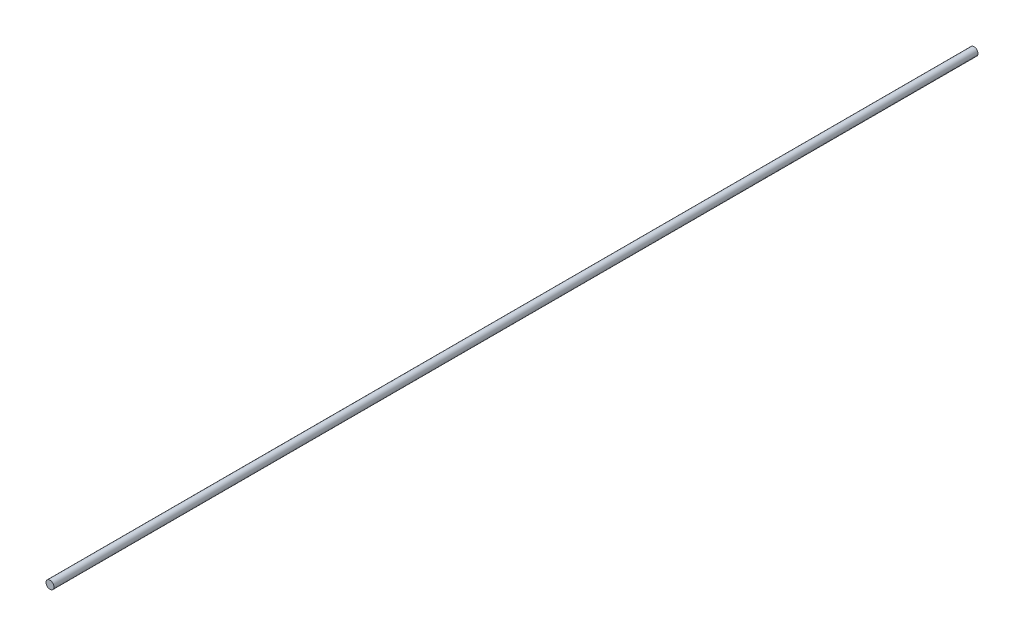
ISO-10303-21;
HEADER;
FILE_DESCRIPTION(('STEP AP214'),'2;1');
FILE_NAME('part.step','',(''),(''),'','','');
FILE_SCHEMA(('AUTOMOTIVE_DESIGN { 1 0 10303 214 1 1 1 1 }'));
ENDSEC;
DATA;
#1=APPLICATION_CONTEXT('core data for automotive mechanical design processes');
#2=APPLICATION_PROTOCOL_DEFINITION('international standard','automotive_design',2000,#1);
#3=PRODUCT_CONTEXT('',#1,'mechanical');
#4=PRODUCT('Part','Part','',(#3));
#5=PRODUCT_RELATED_PRODUCT_CATEGORY('part','',(#4));
#6=PRODUCT_DEFINITION_FORMATION('','',#4);
#7=PRODUCT_DEFINITION_CONTEXT('part definition',#1,'design');
#8=PRODUCT_DEFINITION('design','',#6,#7);
#9=PRODUCT_DEFINITION_SHAPE('','',#8);
#10=(LENGTH_UNIT() NAMED_UNIT(*) SI_UNIT(.MILLI.,.METRE.));
#11=(NAMED_UNIT(*) PLANE_ANGLE_UNIT() SI_UNIT($,.RADIAN.));
#12=(NAMED_UNIT(*) SI_UNIT($,.STERADIAN.) SOLID_ANGLE_UNIT());
#13=UNCERTAINTY_MEASURE_WITH_UNIT(LENGTH_MEASURE(1.E-05),#10,'distance_accuracy_value','');
#14=(GEOMETRIC_REPRESENTATION_CONTEXT(3) GLOBAL_UNCERTAINTY_ASSIGNED_CONTEXT((#13)) GLOBAL_UNIT_ASSIGNED_CONTEXT((#10,
#11,#12)) REPRESENTATION_CONTEXT('',''));
#15=CARTESIAN_POINT('',(0.,0.,0.));
#16=DIRECTION('',(0.,0.,1.));
#17=DIRECTION('',(1.,0.,0.));
#18=AXIS2_PLACEMENT_3D('',#15,#16,#17);
#19=CARTESIAN_POINT('',(0.,0.,930.));
#20=DIRECTION('',(0.,0.,-1.));
#21=DIRECTION('',(-1.,0.,0.));
#22=AXIS2_PLACEMENT_3D('',#19,#20,#21);
#23=CYLINDRICAL_SURFACE('',#22,4.);
#24=CARTESIAN_POINT('',(0.,0.,930.));
#25=DIRECTION('',(0.,0.,1.));
#26=DIRECTION('',(1.,0.,0.));
#27=AXIS2_PLACEMENT_3D('',#24,#25,#26);
#28=CIRCLE('',#27,4.);
#29=CARTESIAN_POINT('',(4.,0.,930.));
#30=VERTEX_POINT('',#29);
#31=EDGE_CURVE('E10',#30,#30,#28,.T.);
#32=ORIENTED_EDGE('',*,*,#31,.F.);
#33=EDGE_LOOP('',(#32));
#34=FACE_BOUND('',#33,.T.);
#35=CARTESIAN_POINT('',(0.,0.,0.));
#36=DIRECTION('',(0.,0.,1.));
#37=DIRECTION('',(1.,0.,0.));
#38=AXIS2_PLACEMENT_3D('',#35,#36,#37);
#39=CIRCLE('',#38,4.);
#40=CARTESIAN_POINT('',(4.,0.,0.));
#41=VERTEX_POINT('',#40);
#42=EDGE_CURVE('E40',#41,#41,#39,.T.);
#43=ORIENTED_EDGE('',*,*,#42,.T.);
#44=EDGE_LOOP('',(#43));
#45=FACE_BOUND('',#44,.T.);
#46=ADVANCED_FACE('F37',(#34,#45),#23,.T.);
#47=CARTESIAN_POINT('',(0.,0.,930.));
#48=DIRECTION('',(0.,0.,1.));
#49=DIRECTION('',(1.,0.,0.));
#50=AXIS2_PLACEMENT_3D('',#47,#48,#49);
#51=PLANE('',#50);
#52=ORIENTED_EDGE('',*,*,#31,.T.);
#53=EDGE_LOOP('',(#52));
#54=FACE_BOUND('',#53,.T.);
#55=ADVANCED_FACE('F54',(#54),#51,.T.);
#56=CARTESIAN_POINT('',(0.,0.,0.));
#57=DIRECTION('',(0.,0.,1.));
#58=DIRECTION('',(1.,0.,0.));
#59=AXIS2_PLACEMENT_3D('',#56,#57,#58);
#60=PLANE('',#59);
#61=ORIENTED_EDGE('',*,*,#42,.F.);
#62=EDGE_LOOP('',(#61));
#63=FACE_BOUND('',#62,.T.);
#64=ADVANCED_FACE('F52',(#63),#60,.F.);
#65=CLOSED_SHELL('',(#46,#55,#64));
#66=MANIFOLD_SOLID_BREP('B2',#65);
#67=ADVANCED_BREP_SHAPE_REPRESENTATION('',(#18,#66),#14);
#68=SHAPE_DEFINITION_REPRESENTATION(#9,#67);
ENDSEC;
END-ISO-10303-21;
